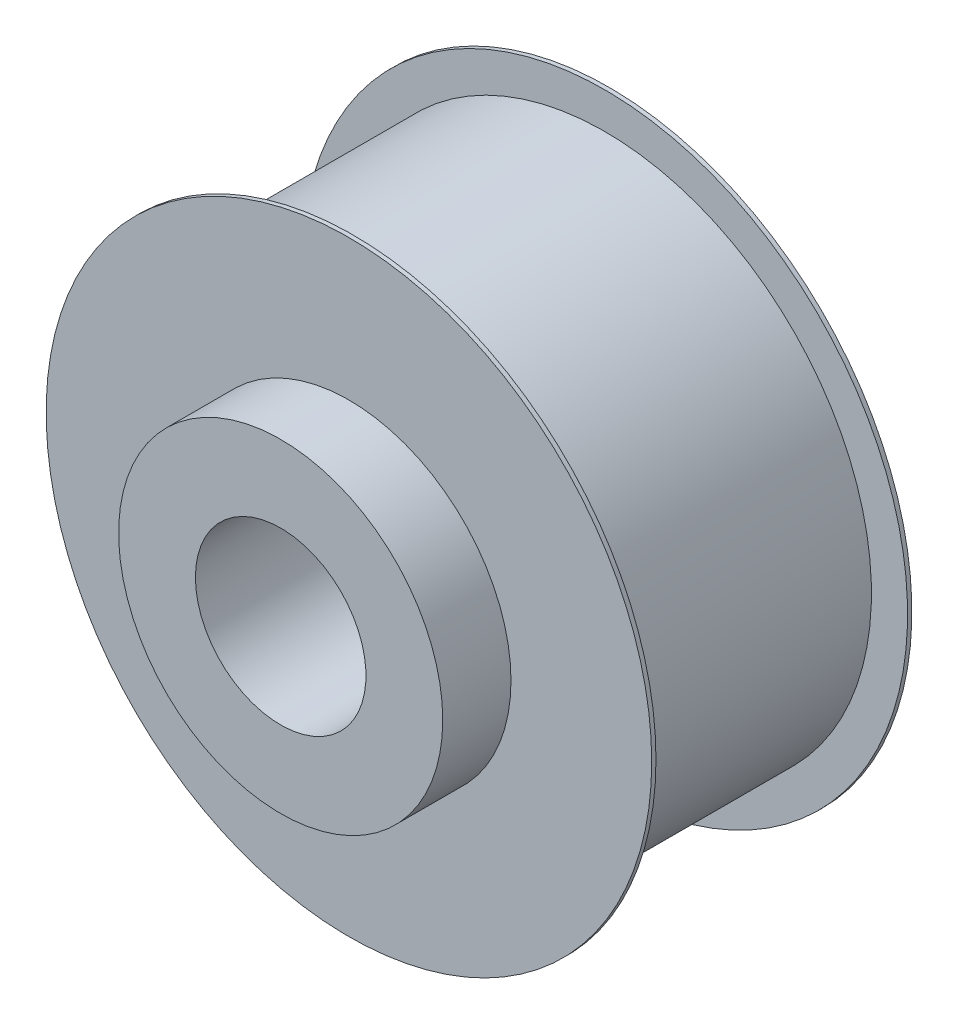
ISO-10303-21;
HEADER;
FILE_DESCRIPTION(('STEP AP214'),'2;1');
FILE_NAME('part.step','',(''),(''),'','','');
FILE_SCHEMA(('AUTOMOTIVE_DESIGN { 1 0 10303 214 1 1 1 1 }'));
ENDSEC;
DATA;
#1=APPLICATION_CONTEXT('core data for automotive mechanical design processes');
#2=APPLICATION_PROTOCOL_DEFINITION('international standard','automotive_design',2000,#1);
#3=PRODUCT_CONTEXT('',#1,'mechanical');
#4=PRODUCT('Part','Part','',(#3));
#5=PRODUCT_RELATED_PRODUCT_CATEGORY('part','',(#4));
#6=PRODUCT_DEFINITION_FORMATION('','',#4);
#7=PRODUCT_DEFINITION_CONTEXT('part definition',#1,'design');
#8=PRODUCT_DEFINITION('design','',#6,#7);
#9=PRODUCT_DEFINITION_SHAPE('','',#8);
#10=(LENGTH_UNIT() NAMED_UNIT(*) SI_UNIT(.MILLI.,.METRE.));
#11=(NAMED_UNIT(*) PLANE_ANGLE_UNIT() SI_UNIT($,.RADIAN.));
#12=(NAMED_UNIT(*) SI_UNIT($,.STERADIAN.) SOLID_ANGLE_UNIT());
#13=UNCERTAINTY_MEASURE_WITH_UNIT(LENGTH_MEASURE(1.E-05),#10,'distance_accuracy_value','');
#14=(GEOMETRIC_REPRESENTATION_CONTEXT(3) GLOBAL_UNCERTAINTY_ASSIGNED_CONTEXT((#13)) GLOBAL_UNIT_ASSIGNED_CONTEXT((#10,
#11,#12)) REPRESENTATION_CONTEXT('',''));
#15=CARTESIAN_POINT('',(0.,0.,0.));
#16=DIRECTION('',(0.,0.,1.));
#17=DIRECTION('',(1.,0.,0.));
#18=AXIS2_PLACEMENT_3D('',#15,#16,#17);
#19=CARTESIAN_POINT('',(0.,0.,30.5));
#20=DIRECTION('',(0.,0.,-1.));
#21=DIRECTION('',(-1.,0.,0.));
#22=AXIS2_PLACEMENT_3D('',#19,#20,#21);
#23=CYLINDRICAL_SURFACE('',#22,31.26);
#24=CARTESIAN_POINT('',(0.,0.,30.));
#25=DIRECTION('',(0.,0.,1.));
#26=DIRECTION('',(1.,0.,0.));
#27=AXIS2_PLACEMENT_3D('',#24,#25,#26);
#28=CIRCLE('',#27,31.26);
#29=CARTESIAN_POINT('',(31.26,0.,30.));
#30=VERTEX_POINT('',#29);
#31=EDGE_CURVE('E39',#30,#30,#28,.T.);
#32=ORIENTED_EDGE('',*,*,#31,.F.);
#33=EDGE_LOOP('',(#32));
#34=FACE_BOUND('',#33,.T.);
#35=CARTESIAN_POINT('',(0.,0.,0.5));
#36=DIRECTION('',(0.,0.,-1.));
#37=DIRECTION('',(-1.,0.,0.));
#38=AXIS2_PLACEMENT_3D('',#35,#36,#37);
#39=CIRCLE('',#38,31.26);
#40=CARTESIAN_POINT('',(-31.26,0.,0.5));
#41=VERTEX_POINT('',#40);
#42=EDGE_CURVE('E10',#41,#41,#39,.T.);
#43=ORIENTED_EDGE('',*,*,#42,.F.);
#44=EDGE_LOOP('',(#43));
#45=FACE_BOUND('',#44,.T.);
#46=ADVANCED_FACE('F33',(#34,#45),#23,.T.);
#47=CARTESIAN_POINT('',(0.,0.,30.5));
#48=DIRECTION('',(0.,0.,1.));
#49=DIRECTION('',(1.,0.,0.));
#50=AXIS2_PLACEMENT_3D('',#47,#48,#49);
#51=PLANE('',#50);
#52=CARTESIAN_POINT('',(0.,0.,30.5));
#53=DIRECTION('',(0.,0.,1.));
#54=DIRECTION('',(1.,0.,0.));
#55=AXIS2_PLACEMENT_3D('',#52,#53,#54);
#56=CIRCLE('',#55,19.);
#57=CARTESIAN_POINT('',(19.,0.,30.5));
#58=VERTEX_POINT('',#57);
#59=EDGE_CURVE('E43',#58,#58,#56,.T.);
#60=ORIENTED_EDGE('',*,*,#59,.F.);
#61=EDGE_LOOP('',(#60));
#62=FACE_BOUND('',#61,.T.);
#63=CARTESIAN_POINT('',(0.,0.,30.5));
#64=DIRECTION('',(0.,0.,1.));
#65=DIRECTION('',(1.,0.,0.));
#66=AXIS2_PLACEMENT_3D('',#63,#64,#65);
#67=CIRCLE('',#66,35.5);
#68=CARTESIAN_POINT('',(35.5,0.,30.5));
#69=VERTEX_POINT('',#68);
#70=EDGE_CURVE('E53',#69,#69,#67,.T.);
#71=ORIENTED_EDGE('',*,*,#70,.T.);
#72=EDGE_LOOP('',(#71));
#73=FACE_BOUND('',#72,.T.);
#74=ADVANCED_FACE('F100',(#62,#73),#51,.T.);
#75=CARTESIAN_POINT('',(0.,0.,38.5));
#76=DIRECTION('',(0.,0.,-1.));
#77=DIRECTION('',(-1.,0.,0.));
#78=AXIS2_PLACEMENT_3D('',#75,#76,#77);
#79=CYLINDRICAL_SURFACE('',#78,19.);
#80=CARTESIAN_POINT('',(0.,0.,38.5));
#81=DIRECTION('',(0.,0.,1.));
#82=DIRECTION('',(1.,0.,0.));
#83=AXIS2_PLACEMENT_3D('',#80,#81,#82);
#84=CIRCLE('',#83,19.);
#85=CARTESIAN_POINT('',(19.,0.,38.5));
#86=VERTEX_POINT('',#85);
#87=EDGE_CURVE('E47',#86,#86,#84,.T.);
#88=ORIENTED_EDGE('',*,*,#87,.F.);
#89=EDGE_LOOP('',(#88));
#90=FACE_BOUND('',#89,.T.);
#91=ORIENTED_EDGE('',*,*,#59,.T.);
#92=EDGE_LOOP('',(#91));
#93=FACE_BOUND('',#92,.T.);
#94=ADVANCED_FACE('F106',(#90,#93),#79,.T.);
#95=CARTESIAN_POINT('',(0.,0.,38.5));
#96=DIRECTION('',(0.,0.,1.));
#97=DIRECTION('',(1.,0.,0.));
#98=AXIS2_PLACEMENT_3D('',#95,#96,#97);
#99=PLANE('',#98);
#100=CARTESIAN_POINT('',(0.,0.,38.5));
#101=DIRECTION('',(0.,0.,-1.));
#102=DIRECTION('',(-1.,0.,0.));
#103=AXIS2_PLACEMENT_3D('',#100,#101,#102);
#104=CIRCLE('',#103,10.);
#105=CARTESIAN_POINT('',(-10.,0.,38.5));
#106=VERTEX_POINT('',#105);
#107=EDGE_CURVE('E62',#106,#106,#104,.T.);
#108=ORIENTED_EDGE('',*,*,#107,.T.);
#109=EDGE_LOOP('',(#108));
#110=FACE_BOUND('',#109,.T.);
#111=ORIENTED_EDGE('',*,*,#87,.T.);
#112=EDGE_LOOP('',(#111));
#113=FACE_BOUND('',#112,.T.);
#114=ADVANCED_FACE('F71',(#110,#113),#99,.T.);
#115=CARTESIAN_POINT('',(0.,0.,30.));
#116=DIRECTION('',(0.,0.,1.));
#117=DIRECTION('',(1.,0.,0.));
#118=AXIS2_PLACEMENT_3D('',#115,#116,#117);
#119=CYLINDRICAL_SURFACE('',#118,35.5);
#120=CARTESIAN_POINT('',(0.,0.,30.));
#121=DIRECTION('',(0.,0.,1.));
#122=DIRECTION('',(1.,0.,0.));
#123=AXIS2_PLACEMENT_3D('',#120,#121,#122);
#124=CIRCLE('',#123,35.5);
#125=CARTESIAN_POINT('',(35.5,0.,30.));
#126=VERTEX_POINT('',#125);
#127=EDGE_CURVE('E52',#126,#126,#124,.T.);
#128=ORIENTED_EDGE('',*,*,#127,.T.);
#129=EDGE_LOOP('',(#128));
#130=FACE_BOUND('',#129,.T.);
#131=ORIENTED_EDGE('',*,*,#70,.F.);
#132=EDGE_LOOP('',(#131));
#133=FACE_BOUND('',#132,.T.);
#134=ADVANCED_FACE('F97',(#130,#133),#119,.T.);
#135=CARTESIAN_POINT('',(0.,0.,30.));
#136=DIRECTION('',(0.,0.,1.));
#137=DIRECTION('',(1.,0.,0.));
#138=AXIS2_PLACEMENT_3D('',#135,#136,#137);
#139=PLANE('',#138);
#140=ORIENTED_EDGE('',*,*,#31,.T.);
#141=EDGE_LOOP('',(#140));
#142=FACE_BOUND('',#141,.T.);
#143=ORIENTED_EDGE('',*,*,#127,.F.);
#144=EDGE_LOOP('',(#143));
#145=FACE_BOUND('',#144,.T.);
#146=ADVANCED_FACE('F88',(#142,#145),#139,.F.);
#147=CARTESIAN_POINT('',(0.,0.,0.5));
#148=DIRECTION('',(0.,0.,-1.));
#149=DIRECTION('',(-1.,0.,0.));
#150=AXIS2_PLACEMENT_3D('',#147,#148,#149);
#151=CYLINDRICAL_SURFACE('',#150,35.5);
#152=CARTESIAN_POINT('',(0.,0.,0.5));
#153=DIRECTION('',(0.,0.,-1.));
#154=DIRECTION('',(-1.,0.,0.));
#155=AXIS2_PLACEMENT_3D('',#152,#153,#154);
#156=CIRCLE('',#155,35.5);
#157=CARTESIAN_POINT('',(-35.5,0.,0.5));
#158=VERTEX_POINT('',#157);
#159=EDGE_CURVE('E56',#158,#158,#156,.T.);
#160=ORIENTED_EDGE('',*,*,#159,.T.);
#161=EDGE_LOOP('',(#160));
#162=FACE_BOUND('',#161,.T.);
#163=CARTESIAN_POINT('',(0.,0.,0.));
#164=DIRECTION('',(0.,0.,-1.));
#165=DIRECTION('',(-1.,0.,0.));
#166=AXIS2_PLACEMENT_3D('',#163,#164,#165);
#167=CIRCLE('',#166,35.5);
#168=CARTESIAN_POINT('',(-35.5,0.,0.));
#169=VERTEX_POINT('',#168);
#170=EDGE_CURVE('E59',#169,#169,#167,.T.);
#171=ORIENTED_EDGE('',*,*,#170,.F.);
#172=EDGE_LOOP('',(#171));
#173=FACE_BOUND('',#172,.T.);
#174=ADVANCED_FACE('F86',(#162,#173),#151,.T.);
#175=CARTESIAN_POINT('',(0.,0.,0.5));
#176=DIRECTION('',(0.,0.,-1.));
#177=DIRECTION('',(-1.,0.,0.));
#178=AXIS2_PLACEMENT_3D('',#175,#176,#177);
#179=PLANE('',#178);
#180=ORIENTED_EDGE('',*,*,#42,.T.);
#181=EDGE_LOOP('',(#180));
#182=FACE_BOUND('',#181,.T.);
#183=ORIENTED_EDGE('',*,*,#159,.F.);
#184=EDGE_LOOP('',(#183));
#185=FACE_BOUND('',#184,.T.);
#186=ADVANCED_FACE('F83',(#182,#185),#179,.F.);
#187=CARTESIAN_POINT('',(0.,0.,0.));
#188=DIRECTION('',(0.,0.,1.));
#189=DIRECTION('',(1.,0.,0.));
#190=AXIS2_PLACEMENT_3D('',#187,#188,#189);
#191=PLANE('',#190);
#192=CARTESIAN_POINT('',(0.,0.,0.));
#193=DIRECTION('',(0.,0.,-1.));
#194=DIRECTION('',(-1.,0.,0.));
#195=AXIS2_PLACEMENT_3D('',#192,#193,#194);
#196=CIRCLE('',#195,10.);
#197=CARTESIAN_POINT('',(-10.,0.,0.));
#198=VERTEX_POINT('',#197);
#199=EDGE_CURVE('E65',#198,#198,#196,.T.);
#200=ORIENTED_EDGE('',*,*,#199,.F.);
#201=EDGE_LOOP('',(#200));
#202=FACE_BOUND('',#201,.T.);
#203=ORIENTED_EDGE('',*,*,#170,.T.);
#204=EDGE_LOOP('',(#203));
#205=FACE_BOUND('',#204,.T.);
#206=ADVANCED_FACE('F77',(#202,#205),#191,.F.);
#207=CARTESIAN_POINT('',(0.,0.,38.5));
#208=DIRECTION('',(0.,0.,-1.));
#209=DIRECTION('',(-1.,0.,0.));
#210=AXIS2_PLACEMENT_3D('',#207,#208,#209);
#211=CYLINDRICAL_SURFACE('',#210,10.);
#212=ORIENTED_EDGE('',*,*,#107,.F.);
#213=EDGE_LOOP('',(#212));
#214=FACE_BOUND('',#213,.T.);
#215=ORIENTED_EDGE('',*,*,#199,.T.);
#216=EDGE_LOOP('',(#215));
#217=FACE_BOUND('',#216,.T.);
#218=ADVANCED_FACE('F74',(#214,#217),#211,.F.);
#219=CLOSED_SHELL('',(#46,#74,#94,#114,#134,#146,#174,#186,#206,#218));
#220=MANIFOLD_SOLID_BREP('B2',#219);
#221=ADVANCED_BREP_SHAPE_REPRESENTATION('',(#18,#220),#14);
#222=SHAPE_DEFINITION_REPRESENTATION(#9,#221);
ENDSEC;
END-ISO-10303-21;
